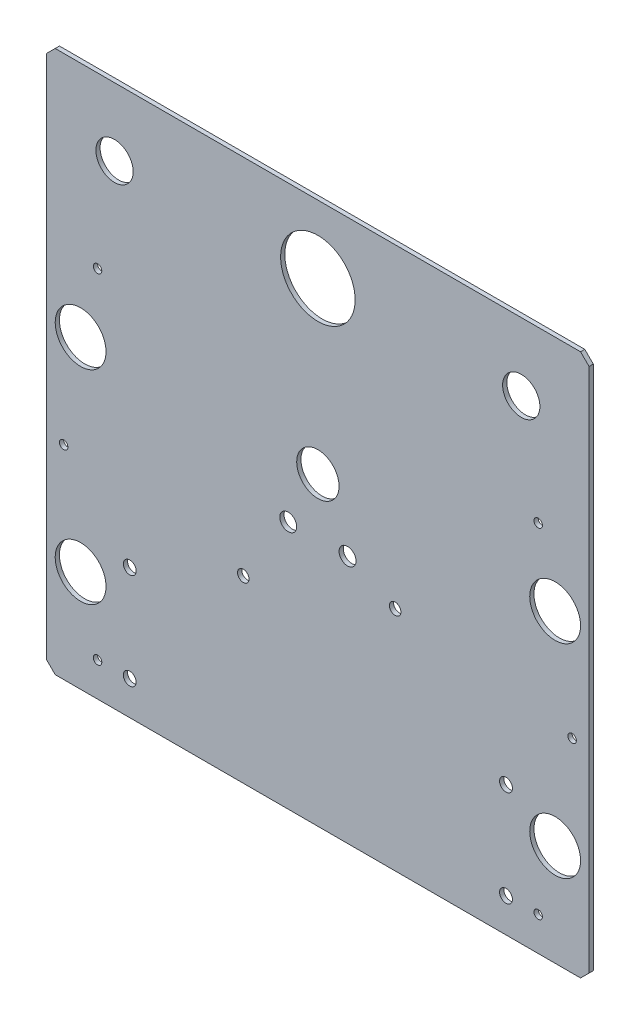
ISO-10303-21;
HEADER;
FILE_DESCRIPTION(('STEP AP214'),'2;1');
FILE_NAME('part.step','',(''),(''),'','','');
FILE_SCHEMA(('AUTOMOTIVE_DESIGN { 1 0 10303 214 1 1 1 1 }'));
ENDSEC;
DATA;
#1=APPLICATION_CONTEXT('core data for automotive mechanical design processes');
#2=APPLICATION_PROTOCOL_DEFINITION('international standard','automotive_design',2000,#1);
#3=PRODUCT_CONTEXT('',#1,'mechanical');
#4=PRODUCT('Part','Part','',(#3));
#5=PRODUCT_RELATED_PRODUCT_CATEGORY('part','',(#4));
#6=PRODUCT_DEFINITION_FORMATION('','',#4);
#7=PRODUCT_DEFINITION_CONTEXT('part definition',#1,'design');
#8=PRODUCT_DEFINITION('design','',#6,#7);
#9=PRODUCT_DEFINITION_SHAPE('','',#8);
#10=(LENGTH_UNIT() NAMED_UNIT(*) SI_UNIT(.MILLI.,.METRE.));
#11=(NAMED_UNIT(*) PLANE_ANGLE_UNIT() SI_UNIT($,.RADIAN.));
#12=(NAMED_UNIT(*) SI_UNIT($,.STERADIAN.) SOLID_ANGLE_UNIT());
#13=UNCERTAINTY_MEASURE_WITH_UNIT(LENGTH_MEASURE(1.E-05),#10,'distance_accuracy_value','');
#14=(GEOMETRIC_REPRESENTATION_CONTEXT(3) GLOBAL_UNCERTAINTY_ASSIGNED_CONTEXT((#13)) GLOBAL_UNIT_ASSIGNED_CONTEXT((#10,
#11,#12)) REPRESENTATION_CONTEXT('',''));
#15=CARTESIAN_POINT('',(0.,0.,0.));
#16=DIRECTION('',(0.,0.,1.));
#17=DIRECTION('',(1.,0.,0.));
#18=AXIS2_PLACEMENT_3D('',#15,#16,#17);
#19=CARTESIAN_POINT('',(0.,0.,-1.5875));
#20=DIRECTION('',(-1.,0.,0.));
#21=DIRECTION('',(0.,0.,1.));
#22=AXIS2_PLACEMENT_3D('',#19,#20,#21);
#23=PLANE('',#22);
#24=DIRECTION('',(0.,-1.,0.));
#25=VECTOR('',#24,1.);
#26=CARTESIAN_POINT('',(0.,0.,0.));
#27=LINE('',#26,#25);
#28=CARTESIAN_POINT('',(0.,200.025,0.));
#29=VERTEX_POINT('',#28);
#30=CARTESIAN_POINT('',(0.,3.17500000000002,0.));
#31=VERTEX_POINT('',#30);
#32=EDGE_CURVE('E99',#29,#31,#27,.T.);
#33=ORIENTED_EDGE('',*,*,#32,.F.);
#34=DIRECTION('',(0.,0.,-1.));
#35=VECTOR('',#34,1.);
#36=CARTESIAN_POINT('',(0.,200.025,-1.5875));
#37=LINE('',#36,#35);
#38=CARTESIAN_POINT('',(0.,200.025,-1.5875));
#39=VERTEX_POINT('',#38);
#40=EDGE_CURVE('E47',#29,#39,#37,.T.);
#41=ORIENTED_EDGE('',*,*,#40,.T.);
#42=DIRECTION('',(0.,-1.,0.));
#43=VECTOR('',#42,1.);
#44=CARTESIAN_POINT('',(0.,0.,-1.5875));
#45=LINE('',#44,#43);
#46=CARTESIAN_POINT('',(0.,3.17500000000002,-1.5875));
#47=VERTEX_POINT('',#46);
#48=EDGE_CURVE('E117',#39,#47,#45,.T.);
#49=ORIENTED_EDGE('',*,*,#48,.T.);
#50=DIRECTION('',(0.,0.,1.));
#51=VECTOR('',#50,1.);
#52=CARTESIAN_POINT('',(0.,3.17500000000002,-1.5875));
#53=LINE('',#52,#51);
#54=EDGE_CURVE('E114',#47,#31,#53,.T.);
#55=ORIENTED_EDGE('',*,*,#54,.T.);
#56=EDGE_LOOP('',(#33,#41,#49,#55));
#57=FACE_BOUND('',#56,.T.);
#58=ADVANCED_FACE('F38',(#57),#23,.T.);
#59=CARTESIAN_POINT('',(0.,203.2,-1.5875));
#60=DIRECTION('',(0.,1.,0.));
#61=DIRECTION('',(0.,0.,1.));
#62=AXIS2_PLACEMENT_3D('',#59,#60,#61);
#63=PLANE('',#62);
#64=DIRECTION('',(-1.,0.,0.));
#65=VECTOR('',#64,1.);
#66=CARTESIAN_POINT('',(0.,203.2,-1.5875));
#67=LINE('',#66,#65);
#68=CARTESIAN_POINT('',(200.025,203.2,-1.5875));
#69=VERTEX_POINT('',#68);
#70=CARTESIAN_POINT('',(3.17500000000002,203.2,-1.5875));
#71=VERTEX_POINT('',#70);
#72=EDGE_CURVE('E119',#69,#71,#67,.T.);
#73=ORIENTED_EDGE('',*,*,#72,.T.);
#74=DIRECTION('',(0.,0.,1.));
#75=VECTOR('',#74,1.);
#76=CARTESIAN_POINT('',(3.17500000000002,203.2,-1.5875));
#77=LINE('',#76,#75);
#78=CARTESIAN_POINT('',(3.17500000000002,203.2,0.));
#79=VERTEX_POINT('',#78);
#80=EDGE_CURVE('E149',#71,#79,#77,.T.);
#81=ORIENTED_EDGE('',*,*,#80,.T.);
#82=DIRECTION('',(-1.,0.,0.));
#83=VECTOR('',#82,1.);
#84=CARTESIAN_POINT('',(0.,203.2,0.));
#85=LINE('',#84,#83);
#86=CARTESIAN_POINT('',(200.025,203.2,0.));
#87=VERTEX_POINT('',#86);
#88=EDGE_CURVE('E125',#87,#79,#85,.T.);
#89=ORIENTED_EDGE('',*,*,#88,.F.);
#90=DIRECTION('',(0.,0.,-1.));
#91=VECTOR('',#90,1.);
#92=CARTESIAN_POINT('',(200.025,203.2,-1.5875));
#93=LINE('',#92,#91);
#94=EDGE_CURVE('E145',#87,#69,#93,.T.);
#95=ORIENTED_EDGE('',*,*,#94,.T.);
#96=EDGE_LOOP('',(#73,#81,#89,#95));
#97=FACE_BOUND('',#96,.T.);
#98=ADVANCED_FACE('F155',(#97),#63,.T.);
#99=CARTESIAN_POINT('',(203.2,0.,-1.5875));
#100=DIRECTION('',(1.,0.,0.));
#101=DIRECTION('',(0.,0.,-1.));
#102=AXIS2_PLACEMENT_3D('',#99,#100,#101);
#103=PLANE('',#102);
#104=DIRECTION('',(0.,1.,0.));
#105=VECTOR('',#104,1.);
#106=CARTESIAN_POINT('',(203.2,0.,-1.5875));
#107=LINE('',#106,#105);
#108=CARTESIAN_POINT('',(203.2,3.17500000000002,-1.5875));
#109=VERTEX_POINT('',#108);
#110=CARTESIAN_POINT('',(203.2,200.025,-1.5875));
#111=VERTEX_POINT('',#110);
#112=EDGE_CURVE('E122',#109,#111,#107,.T.);
#113=ORIENTED_EDGE('',*,*,#112,.T.);
#114=DIRECTION('',(0.,0.,1.));
#115=VECTOR('',#114,1.);
#116=CARTESIAN_POINT('',(203.2,200.025,-1.5875));
#117=LINE('',#116,#115);
#118=CARTESIAN_POINT('',(203.2,200.025,0.));
#119=VERTEX_POINT('',#118);
#120=EDGE_CURVE('E140',#111,#119,#117,.T.);
#121=ORIENTED_EDGE('',*,*,#120,.T.);
#122=DIRECTION('',(0.,1.,0.));
#123=VECTOR('',#122,1.);
#124=CARTESIAN_POINT('',(203.2,0.,0.));
#125=LINE('',#124,#123);
#126=CARTESIAN_POINT('',(203.2,3.17500000000002,0.));
#127=VERTEX_POINT('',#126);
#128=EDGE_CURVE('E161',#127,#119,#125,.T.);
#129=ORIENTED_EDGE('',*,*,#128,.F.);
#130=DIRECTION('',(0.,0.,-1.));
#131=VECTOR('',#130,1.);
#132=CARTESIAN_POINT('',(203.2,3.17500000000002,-1.5875));
#133=LINE('',#132,#131);
#134=EDGE_CURVE('E136',#127,#109,#133,.T.);
#135=ORIENTED_EDGE('',*,*,#134,.T.);
#136=EDGE_LOOP('',(#113,#121,#129,#135));
#137=FACE_BOUND('',#136,.T.);
#138=ADVANCED_FACE('F377',(#137),#103,.T.);
#139=CARTESIAN_POINT('',(0.,0.,-1.5875));
#140=DIRECTION('',(0.,-1.,0.));
#141=DIRECTION('',(0.,0.,-1.));
#142=AXIS2_PLACEMENT_3D('',#139,#140,#141);
#143=PLANE('',#142);
#144=DIRECTION('',(1.,0.,0.));
#145=VECTOR('',#144,1.);
#146=CARTESIAN_POINT('',(0.,0.,-1.5875));
#147=LINE('',#146,#145);
#148=CARTESIAN_POINT('',(3.17500000000002,0.,-1.5875));
#149=VERTEX_POINT('',#148);
#150=CARTESIAN_POINT('',(200.025,0.,-1.5875));
#151=VERTEX_POINT('',#150);
#152=EDGE_CURVE('E162',#149,#151,#147,.T.);
#153=ORIENTED_EDGE('',*,*,#152,.T.);
#154=DIRECTION('',(0.,0.,1.));
#155=VECTOR('',#154,1.);
#156=CARTESIAN_POINT('',(200.025,0.,-1.5875));
#157=LINE('',#156,#155);
#158=CARTESIAN_POINT('',(200.025,0.,0.));
#159=VERTEX_POINT('',#158);
#160=EDGE_CURVE('E131',#151,#159,#157,.T.);
#161=ORIENTED_EDGE('',*,*,#160,.T.);
#162=DIRECTION('',(1.,0.,0.));
#163=VECTOR('',#162,1.);
#164=CARTESIAN_POINT('',(0.,0.,0.));
#165=LINE('',#164,#163);
#166=CARTESIAN_POINT('',(3.17500000000002,0.,0.));
#167=VERTEX_POINT('',#166);
#168=EDGE_CURVE('E106',#167,#159,#165,.T.);
#169=ORIENTED_EDGE('',*,*,#168,.F.);
#170=DIRECTION('',(0.,0.,-1.));
#171=VECTOR('',#170,1.);
#172=CARTESIAN_POINT('',(3.17500000000002,0.,-1.5875));
#173=LINE('',#172,#171);
#174=EDGE_CURVE('E115',#167,#149,#173,.T.);
#175=ORIENTED_EDGE('',*,*,#174,.T.);
#176=EDGE_LOOP('',(#153,#161,#169,#175));
#177=FACE_BOUND('',#176,.T.);
#178=ADVANCED_FACE('F315',(#177),#143,.T.);
#179=CARTESIAN_POINT('',(0.,0.,-1.5875));
#180=DIRECTION('',(0.,0.,-1.));
#181=DIRECTION('',(-1.,0.,0.));
#182=AXIS2_PLACEMENT_3D('',#179,#180,#181);
#183=PLANE('',#182);
#184=CARTESIAN_POINT('',(177.8,177.8,-1.5875));
#185=DIRECTION('',(0.,0.,-1.));
#186=DIRECTION('',(-1.,0.,0.));
#187=AXIS2_PLACEMENT_3D('',#184,#185,#186);
#188=CIRCLE('',#187,6.98499999999999);
#189=CARTESIAN_POINT('',(170.815,177.8,-1.5875));
#190=VERTEX_POINT('',#189);
#191=EDGE_CURVE('E280',#190,#190,#188,.T.);
#192=ORIENTED_EDGE('',*,*,#191,.F.);
#193=EDGE_LOOP('',(#192));
#194=FACE_BOUND('',#193,.T.);
#195=CARTESIAN_POINT('',(73.6599999999998,67.31,-1.5875));
#196=DIRECTION('',(0.,0.,-1.));
#197=DIRECTION('',(-1.,0.,0.));
#198=AXIS2_PLACEMENT_3D('',#195,#196,#197);
#199=CIRCLE('',#198,2.15900000000001);
#200=CARTESIAN_POINT('',(71.5009999999998,67.31,-1.5875));
#201=VERTEX_POINT('',#200);
#202=EDGE_CURVE('E281',#201,#201,#199,.T.);
#203=ORIENTED_EDGE('',*,*,#202,.F.);
#204=EDGE_LOOP('',(#203));
#205=FACE_BOUND('',#204,.T.);
#206=CARTESIAN_POINT('',(130.556,85.09,-1.5875));
#207=DIRECTION('',(0.,0.,-1.));
#208=DIRECTION('',(-1.,0.,0.));
#209=AXIS2_PLACEMENT_3D('',#206,#207,#208);
#210=CIRCLE('',#209,2.15899999999999);
#211=CARTESIAN_POINT('',(128.397,85.09,-1.5875));
#212=VERTEX_POINT('',#211);
#213=EDGE_CURVE('E287',#212,#212,#210,.T.);
#214=ORIENTED_EDGE('',*,*,#213,.F.);
#215=EDGE_LOOP('',(#214));
#216=FACE_BOUND('',#215,.T.);
#217=CARTESIAN_POINT('',(90.4875,93.218,-1.5875));
#218=DIRECTION('',(0.,0.,-1.));
#219=DIRECTION('',(-1.,0.,0.));
#220=AXIS2_PLACEMENT_3D('',#217,#218,#219);
#221=CIRCLE('',#220,3.175);
#222=CARTESIAN_POINT('',(87.3125,93.218,-1.5875));
#223=VERTEX_POINT('',#222);
#224=EDGE_CURVE('E293',#223,#223,#221,.T.);
#225=ORIENTED_EDGE('',*,*,#224,.F.);
#226=EDGE_LOOP('',(#225));
#227=FACE_BOUND('',#226,.T.);
#228=CARTESIAN_POINT('',(112.7125,93.218,-1.5875));
#229=DIRECTION('',(0.,0.,-1.));
#230=DIRECTION('',(-1.,0.,0.));
#231=AXIS2_PLACEMENT_3D('',#228,#229,#230);
#232=CIRCLE('',#231,3.175);
#233=CARTESIAN_POINT('',(109.5375,93.218,-1.5875));
#234=VERTEX_POINT('',#233);
#235=EDGE_CURVE('E255',#234,#234,#232,.T.);
#236=ORIENTED_EDGE('',*,*,#235,.F.);
#237=EDGE_LOOP('',(#236));
#238=FACE_BOUND('',#237,.T.);
#239=CARTESIAN_POINT('',(101.6,114.3,-1.5875));
#240=DIRECTION('',(0.,0.,-1.));
#241=DIRECTION('',(-1.,0.,0.));
#242=AXIS2_PLACEMENT_3D('',#239,#240,#241);
#243=CIRCLE('',#242,7.93749999999998);
#244=CARTESIAN_POINT('',(93.6625,114.3,-1.5875));
#245=VERTEX_POINT('',#244);
#246=EDGE_CURVE('E262',#245,#245,#243,.T.);
#247=ORIENTED_EDGE('',*,*,#246,.F.);
#248=EDGE_LOOP('',(#247));
#249=FACE_BOUND('',#248,.T.);
#250=CARTESIAN_POINT('',(25.4,177.8,-1.5875));
#251=DIRECTION('',(0.,0.,-1.));
#252=DIRECTION('',(-1.,0.,0.));
#253=AXIS2_PLACEMENT_3D('',#250,#251,#252);
#254=CIRCLE('',#253,6.98500000000002);
#255=CARTESIAN_POINT('',(18.415,177.8,-1.5875));
#256=VERTEX_POINT('',#255);
#257=EDGE_CURVE('E268',#256,#256,#254,.T.);
#258=ORIENTED_EDGE('',*,*,#257,.F.);
#259=EDGE_LOOP('',(#258));
#260=FACE_BOUND('',#259,.T.);
#261=CARTESIAN_POINT('',(101.6,177.8,-1.5875));
#262=DIRECTION('',(0.,0.,-1.));
#263=DIRECTION('',(-1.,0.,0.));
#264=AXIS2_PLACEMENT_3D('',#261,#262,#263);
#265=CIRCLE('',#264,13.97);
#266=CARTESIAN_POINT('',(87.63,177.8,-1.5875));
#267=VERTEX_POINT('',#266);
#268=EDGE_CURVE('E274',#267,#267,#265,.T.);
#269=ORIENTED_EDGE('',*,*,#268,.F.);
#270=EDGE_LOOP('',(#269));
#271=FACE_BOUND('',#270,.T.);
#272=CARTESIAN_POINT('',(184.15,12.7,-1.5875));
#273=DIRECTION('',(0.,0.,-1.));
#274=DIRECTION('',(-1.,0.,0.));
#275=AXIS2_PLACEMENT_3D('',#272,#273,#274);
#276=CIRCLE('',#275,1.58749999999999);
#277=CARTESIAN_POINT('',(182.5625,12.7,-1.5875));
#278=VERTEX_POINT('',#277);
#279=EDGE_CURVE('E201',#278,#278,#276,.T.);
#280=ORIENTED_EDGE('',*,*,#279,.F.);
#281=EDGE_LOOP('',(#280));
#282=FACE_BOUND('',#281,.T.);
#283=CARTESIAN_POINT('',(184.15,139.7,-1.5875));
#284=DIRECTION('',(0.,0.,-1.));
#285=DIRECTION('',(-1.,0.,0.));
#286=AXIS2_PLACEMENT_3D('',#283,#284,#285);
#287=CIRCLE('',#286,1.58749999999999);
#288=CARTESIAN_POINT('',(182.5625,139.7,-1.5875));
#289=VERTEX_POINT('',#288);
#290=EDGE_CURVE('E208',#289,#289,#287,.T.);
#291=ORIENTED_EDGE('',*,*,#290,.F.);
#292=EDGE_LOOP('',(#291));
#293=FACE_BOUND('',#292,.T.);
#294=CARTESIAN_POINT('',(172.085,48.768,-1.5875));
#295=DIRECTION('',(0.,0.,-1.));
#296=DIRECTION('',(-1.,0.,0.));
#297=AXIS2_PLACEMENT_3D('',#294,#295,#296);
#298=CIRCLE('',#297,2.41299999999999);
#299=CARTESIAN_POINT('',(169.672,48.768,-1.5875));
#300=VERTEX_POINT('',#299);
#301=EDGE_CURVE('E214',#300,#300,#298,.T.);
#302=ORIENTED_EDGE('',*,*,#301,.F.);
#303=EDGE_LOOP('',(#302));
#304=FACE_BOUND('',#303,.T.);
#305=CARTESIAN_POINT('',(172.085,12.7,-1.5875));
#306=DIRECTION('',(0.,0.,-1.));
#307=DIRECTION('',(-1.,0.,0.));
#308=AXIS2_PLACEMENT_3D('',#305,#306,#307);
#309=CIRCLE('',#308,2.41299999999999);
#310=CARTESIAN_POINT('',(169.672,12.7,-1.5875));
#311=VERTEX_POINT('',#310);
#312=EDGE_CURVE('E220',#311,#311,#309,.T.);
#313=ORIENTED_EDGE('',*,*,#312,.F.);
#314=EDGE_LOOP('',(#313));
#315=FACE_BOUND('',#314,.T.);
#316=CARTESIAN_POINT('',(19.05,12.7,-1.5875));
#317=DIRECTION('',(0.,0.,-1.));
#318=DIRECTION('',(-1.,0.,0.));
#319=AXIS2_PLACEMENT_3D('',#316,#317,#318);
#320=CIRCLE('',#319,1.5875);
#321=CARTESIAN_POINT('',(17.4625,12.7,-1.5875));
#322=VERTEX_POINT('',#321);
#323=EDGE_CURVE('E184',#322,#322,#320,.T.);
#324=ORIENTED_EDGE('',*,*,#323,.F.);
#325=EDGE_LOOP('',(#324));
#326=FACE_BOUND('',#325,.T.);
#327=CARTESIAN_POINT('',(190.5,38.1,-1.5875));
#328=DIRECTION('',(0.,0.,-1.));
#329=DIRECTION('',(-1.,0.,0.));
#330=AXIS2_PLACEMENT_3D('',#327,#328,#329);
#331=CIRCLE('',#330,9.525);
#332=CARTESIAN_POINT('',(180.975,38.1,-1.5875));
#333=VERTEX_POINT('',#332);
#334=EDGE_CURVE('E177',#333,#333,#331,.T.);
#335=ORIENTED_EDGE('',*,*,#334,.F.);
#336=EDGE_LOOP('',(#335));
#337=FACE_BOUND('',#336,.T.);
#338=CARTESIAN_POINT('',(31.115,48.768,-1.5875));
#339=DIRECTION('',(0.,0.,-1.));
#340=DIRECTION('',(-1.,0.,0.));
#341=AXIS2_PLACEMENT_3D('',#338,#339,#340);
#342=CIRCLE('',#341,2.41299999999999);
#343=CARTESIAN_POINT('',(28.702,48.768,-1.5875));
#344=VERTEX_POINT('',#343);
#345=EDGE_CURVE('E196',#344,#344,#342,.T.);
#346=ORIENTED_EDGE('',*,*,#345,.F.);
#347=EDGE_LOOP('',(#346));
#348=FACE_BOUND('',#347,.T.);
#349=CARTESIAN_POINT('',(31.115,12.7,-1.5875));
#350=DIRECTION('',(0.,0.,-1.));
#351=DIRECTION('',(-1.,0.,0.));
#352=AXIS2_PLACEMENT_3D('',#349,#350,#351);
#353=CIRCLE('',#352,2.41300000000001);
#354=CARTESIAN_POINT('',(28.702,12.7,-1.5875));
#355=VERTEX_POINT('',#354);
#356=EDGE_CURVE('E189',#355,#355,#353,.T.);
#357=ORIENTED_EDGE('',*,*,#356,.F.);
#358=EDGE_LOOP('',(#357));
#359=FACE_BOUND('',#358,.T.);
#360=CARTESIAN_POINT('',(196.85,76.2,-1.5875));
#361=DIRECTION('',(0.,0.,-1.));
#362=DIRECTION('',(-1.,0.,0.));
#363=AXIS2_PLACEMENT_3D('',#360,#361,#362);
#364=CIRCLE('',#363,1.58749999999999);
#365=CARTESIAN_POINT('',(195.2625,76.2,-1.5875));
#366=VERTEX_POINT('',#365);
#367=EDGE_CURVE('E249',#366,#366,#364,.T.);
#368=ORIENTED_EDGE('',*,*,#367,.F.);
#369=EDGE_LOOP('',(#368));
#370=FACE_BOUND('',#369,.T.);
#371=CARTESIAN_POINT('',(6.35,76.2,-1.5875));
#372=DIRECTION('',(0.,0.,-1.));
#373=DIRECTION('',(-1.,0.,0.));
#374=AXIS2_PLACEMENT_3D('',#371,#372,#373);
#375=CIRCLE('',#374,1.5875);
#376=CARTESIAN_POINT('',(4.7625,76.2,-1.5875));
#377=VERTEX_POINT('',#376);
#378=EDGE_CURVE('E225',#377,#377,#375,.T.);
#379=ORIENTED_EDGE('',*,*,#378,.F.);
#380=EDGE_LOOP('',(#379));
#381=FACE_BOUND('',#380,.T.);
#382=CARTESIAN_POINT('',(12.7,38.1,-1.5875));
#383=DIRECTION('',(0.,0.,-1.));
#384=DIRECTION('',(-1.,0.,0.));
#385=AXIS2_PLACEMENT_3D('',#382,#383,#384);
#386=CIRCLE('',#385,9.525);
#387=CARTESIAN_POINT('',(3.17500000000004,38.1,-1.5875));
#388=VERTEX_POINT('',#387);
#389=EDGE_CURVE('E232',#388,#388,#386,.T.);
#390=ORIENTED_EDGE('',*,*,#389,.F.);
#391=EDGE_LOOP('',(#390));
#392=FACE_BOUND('',#391,.T.);
#393=CARTESIAN_POINT('',(12.7,114.3,-1.5875));
#394=DIRECTION('',(0.,0.,-1.));
#395=DIRECTION('',(-1.,0.,0.));
#396=AXIS2_PLACEMENT_3D('',#393,#394,#395);
#397=CIRCLE('',#396,9.52500000000001);
#398=CARTESIAN_POINT('',(3.17500000000003,114.3,-1.5875));
#399=VERTEX_POINT('',#398);
#400=EDGE_CURVE('E238',#399,#399,#397,.T.);
#401=ORIENTED_EDGE('',*,*,#400,.F.);
#402=EDGE_LOOP('',(#401));
#403=FACE_BOUND('',#402,.T.);
#404=CARTESIAN_POINT('',(190.5,114.3,-1.5875));
#405=DIRECTION('',(0.,0.,-1.));
#406=DIRECTION('',(-1.,0.,0.));
#407=AXIS2_PLACEMENT_3D('',#404,#405,#406);
#408=CIRCLE('',#407,9.525);
#409=CARTESIAN_POINT('',(180.975,114.3,-1.5875));
#410=VERTEX_POINT('',#409);
#411=EDGE_CURVE('E244',#410,#410,#408,.T.);
#412=ORIENTED_EDGE('',*,*,#411,.F.);
#413=EDGE_LOOP('',(#412));
#414=FACE_BOUND('',#413,.T.);
#415=CARTESIAN_POINT('',(19.05,139.7,-1.5875));
#416=DIRECTION('',(0.,0.,-1.));
#417=DIRECTION('',(-1.,0.,0.));
#418=AXIS2_PLACEMENT_3D('',#415,#416,#417);
#419=CIRCLE('',#418,1.5875);
#420=CARTESIAN_POINT('',(17.4625,139.7,-1.5875));
#421=VERTEX_POINT('',#420);
#422=EDGE_CURVE('E171',#421,#421,#419,.T.);
#423=ORIENTED_EDGE('',*,*,#422,.F.);
#424=EDGE_LOOP('',(#423));
#425=FACE_BOUND('',#424,.T.);
#426=ORIENTED_EDGE('',*,*,#48,.F.);
#427=DIRECTION('',(-0.707106781186549,-0.707106781186546,0.));
#428=VECTOR('',#427,1.);
#429=CARTESIAN_POINT('',(-100.0125,100.0125,-1.5875));
#430=LINE('',#429,#428);
#431=EDGE_CURVE('E11',#39,#71,#430,.F.);
#432=ORIENTED_EDGE('',*,*,#431,.T.);
#433=ORIENTED_EDGE('',*,*,#72,.F.);
#434=DIRECTION('',(-0.707106781186548,0.707106781186548,0.));
#435=VECTOR('',#434,1.);
#436=CARTESIAN_POINT('',(201.6125,201.6125,-1.5875));
#437=LINE('',#436,#435);
#438=EDGE_CURVE('E147',#69,#111,#437,.F.);
#439=ORIENTED_EDGE('',*,*,#438,.T.);
#440=ORIENTED_EDGE('',*,*,#112,.F.);
#441=DIRECTION('',(0.707106781186546,0.707106781186549,0.));
#442=VECTOR('',#441,1.);
#443=CARTESIAN_POINT('',(100.0125,-100.0125,-1.5875));
#444=LINE('',#443,#442);
#445=EDGE_CURVE('E138',#109,#151,#444,.F.);
#446=ORIENTED_EDGE('',*,*,#445,.T.);
#447=ORIENTED_EDGE('',*,*,#152,.F.);
#448=DIRECTION('',(0.707106781186548,-0.707106781186548,0.));
#449=VECTOR('',#448,1.);
#450=CARTESIAN_POINT('',(1.58750000000001,1.58750000000001,-1.5875));
#451=LINE('',#450,#449);
#452=EDGE_CURVE('E129',#149,#47,#451,.F.);
#453=ORIENTED_EDGE('',*,*,#452,.T.);
#454=EDGE_LOOP('',(#426,#432,#433,#439,#440,#446,#447,#453));
#455=FACE_BOUND('',#454,.T.);
#456=ADVANCED_FACE('F312',(#194,#205,#216,#227,#238,#249,#260,#271,#282,#293,#304,#315,#326,
#337,#348,#359,#370,#381,#392,#403,#414,#425,#455),#183,.T.);
#457=CARTESIAN_POINT('',(0.,0.,0.));
#458=DIRECTION('',(0.,0.,-1.));
#459=DIRECTION('',(-1.,0.,0.));
#460=AXIS2_PLACEMENT_3D('',#457,#458,#459);
#461=PLANE('',#460);
#462=CARTESIAN_POINT('',(177.8,177.8,0.));
#463=DIRECTION('',(0.,0.,-1.));
#464=DIRECTION('',(-1.,0.,0.));
#465=AXIS2_PLACEMENT_3D('',#462,#463,#464);
#466=CIRCLE('',#465,6.98499999999999);
#467=CARTESIAN_POINT('',(170.815,177.8,0.));
#468=VERTEX_POINT('',#467);
#469=EDGE_CURVE('E252',#468,#468,#466,.T.);
#470=ORIENTED_EDGE('',*,*,#469,.T.);
#471=EDGE_LOOP('',(#470));
#472=FACE_BOUND('',#471,.T.);
#473=CARTESIAN_POINT('',(73.6599999999998,67.31,0.));
#474=DIRECTION('',(0.,0.,-1.));
#475=DIRECTION('',(-1.,0.,0.));
#476=AXIS2_PLACEMENT_3D('',#473,#474,#475);
#477=CIRCLE('',#476,2.15900000000001);
#478=CARTESIAN_POINT('',(71.5009999999998,67.31,0.));
#479=VERTEX_POINT('',#478);
#480=EDGE_CURVE('E284',#479,#479,#477,.T.);
#481=ORIENTED_EDGE('',*,*,#480,.T.);
#482=EDGE_LOOP('',(#481));
#483=FACE_BOUND('',#482,.T.);
#484=CARTESIAN_POINT('',(130.556,85.09,0.));
#485=DIRECTION('',(0.,0.,-1.));
#486=DIRECTION('',(-1.,0.,0.));
#487=AXIS2_PLACEMENT_3D('',#484,#485,#486);
#488=CIRCLE('',#487,2.15899999999999);
#489=CARTESIAN_POINT('',(128.397,85.09,0.));
#490=VERTEX_POINT('',#489);
#491=EDGE_CURVE('E290',#490,#490,#488,.T.);
#492=ORIENTED_EDGE('',*,*,#491,.T.);
#493=EDGE_LOOP('',(#492));
#494=FACE_BOUND('',#493,.T.);
#495=CARTESIAN_POINT('',(90.4875,93.218,0.));
#496=DIRECTION('',(0.,0.,-1.));
#497=DIRECTION('',(-1.,0.,0.));
#498=AXIS2_PLACEMENT_3D('',#495,#496,#497);
#499=CIRCLE('',#498,3.175);
#500=CARTESIAN_POINT('',(87.3125,93.218,0.));
#501=VERTEX_POINT('',#500);
#502=EDGE_CURVE('E259',#501,#501,#499,.T.);
#503=ORIENTED_EDGE('',*,*,#502,.T.);
#504=EDGE_LOOP('',(#503));
#505=FACE_BOUND('',#504,.T.);
#506=CARTESIAN_POINT('',(112.7125,93.218,0.));
#507=DIRECTION('',(0.,0.,-1.));
#508=DIRECTION('',(-1.,0.,0.));
#509=AXIS2_PLACEMENT_3D('',#506,#507,#508);
#510=CIRCLE('',#509,3.175);
#511=CARTESIAN_POINT('',(109.5375,93.218,0.));
#512=VERTEX_POINT('',#511);
#513=EDGE_CURVE('E258',#512,#512,#510,.T.);
#514=ORIENTED_EDGE('',*,*,#513,.T.);
#515=EDGE_LOOP('',(#514));
#516=FACE_BOUND('',#515,.T.);
#517=CARTESIAN_POINT('',(101.6,114.3,0.));
#518=DIRECTION('',(0.,0.,-1.));
#519=DIRECTION('',(-1.,0.,0.));
#520=AXIS2_PLACEMENT_3D('',#517,#518,#519);
#521=CIRCLE('',#520,7.93749999999998);
#522=CARTESIAN_POINT('',(93.6625,114.3,0.));
#523=VERTEX_POINT('',#522);
#524=EDGE_CURVE('E265',#523,#523,#521,.T.);
#525=ORIENTED_EDGE('',*,*,#524,.T.);
#526=EDGE_LOOP('',(#525));
#527=FACE_BOUND('',#526,.T.);
#528=CARTESIAN_POINT('',(25.4,177.8,0.));
#529=DIRECTION('',(0.,0.,-1.));
#530=DIRECTION('',(-1.,0.,0.));
#531=AXIS2_PLACEMENT_3D('',#528,#529,#530);
#532=CIRCLE('',#531,6.98500000000002);
#533=CARTESIAN_POINT('',(18.415,177.8,0.));
#534=VERTEX_POINT('',#533);
#535=EDGE_CURVE('E271',#534,#534,#532,.T.);
#536=ORIENTED_EDGE('',*,*,#535,.T.);
#537=EDGE_LOOP('',(#536));
#538=FACE_BOUND('',#537,.T.);
#539=CARTESIAN_POINT('',(101.6,177.8,0.));
#540=DIRECTION('',(0.,0.,-1.));
#541=DIRECTION('',(-1.,0.,0.));
#542=AXIS2_PLACEMENT_3D('',#539,#540,#541);
#543=CIRCLE('',#542,13.97);
#544=CARTESIAN_POINT('',(87.63,177.8,0.));
#545=VERTEX_POINT('',#544);
#546=EDGE_CURVE('E277',#545,#545,#543,.T.);
#547=ORIENTED_EDGE('',*,*,#546,.T.);
#548=EDGE_LOOP('',(#547));
#549=FACE_BOUND('',#548,.T.);
#550=CARTESIAN_POINT('',(184.15,12.7,0.));
#551=DIRECTION('',(0.,0.,-1.));
#552=DIRECTION('',(-1.,0.,0.));
#553=AXIS2_PLACEMENT_3D('',#550,#551,#552);
#554=CIRCLE('',#553,1.58749999999999);
#555=CARTESIAN_POINT('',(182.5625,12.7,0.));
#556=VERTEX_POINT('',#555);
#557=EDGE_CURVE('E204',#556,#556,#554,.T.);
#558=ORIENTED_EDGE('',*,*,#557,.T.);
#559=EDGE_LOOP('',(#558));
#560=FACE_BOUND('',#559,.T.);
#561=CARTESIAN_POINT('',(184.15,139.7,0.));
#562=DIRECTION('',(0.,0.,-1.));
#563=DIRECTION('',(-1.,0.,0.));
#564=AXIS2_PLACEMENT_3D('',#561,#562,#563);
#565=CIRCLE('',#564,1.58749999999999);
#566=CARTESIAN_POINT('',(182.5625,139.7,0.));
#567=VERTEX_POINT('',#566);
#568=EDGE_CURVE('E211',#567,#567,#565,.T.);
#569=ORIENTED_EDGE('',*,*,#568,.T.);
#570=EDGE_LOOP('',(#569));
#571=FACE_BOUND('',#570,.T.);
#572=CARTESIAN_POINT('',(172.085,48.768,0.));
#573=DIRECTION('',(0.,0.,-1.));
#574=DIRECTION('',(-1.,0.,0.));
#575=AXIS2_PLACEMENT_3D('',#572,#573,#574);
#576=CIRCLE('',#575,2.41299999999999);
#577=CARTESIAN_POINT('',(169.672,48.768,0.));
#578=VERTEX_POINT('',#577);
#579=EDGE_CURVE('E217',#578,#578,#576,.T.);
#580=ORIENTED_EDGE('',*,*,#579,.T.);
#581=EDGE_LOOP('',(#580));
#582=FACE_BOUND('',#581,.T.);
#583=CARTESIAN_POINT('',(172.085,12.7,0.));
#584=DIRECTION('',(0.,0.,-1.));
#585=DIRECTION('',(-1.,0.,0.));
#586=AXIS2_PLACEMENT_3D('',#583,#584,#585);
#587=CIRCLE('',#586,2.41299999999999);
#588=CARTESIAN_POINT('',(169.672,12.7,0.));
#589=VERTEX_POINT('',#588);
#590=EDGE_CURVE('E193',#589,#589,#587,.T.);
#591=ORIENTED_EDGE('',*,*,#590,.T.);
#592=EDGE_LOOP('',(#591));
#593=FACE_BOUND('',#592,.T.);
#594=CARTESIAN_POINT('',(19.05,12.7,0.));
#595=DIRECTION('',(0.,0.,-1.));
#596=DIRECTION('',(-1.,0.,0.));
#597=AXIS2_PLACEMENT_3D('',#594,#595,#596);
#598=CIRCLE('',#597,1.5875);
#599=CARTESIAN_POINT('',(17.4625,12.7,0.));
#600=VERTEX_POINT('',#599);
#601=EDGE_CURVE('E174',#600,#600,#598,.T.);
#602=ORIENTED_EDGE('',*,*,#601,.T.);
#603=EDGE_LOOP('',(#602));
#604=FACE_BOUND('',#603,.T.);
#605=CARTESIAN_POINT('',(190.5,38.1,0.));
#606=DIRECTION('',(0.,0.,-1.));
#607=DIRECTION('',(-1.,0.,0.));
#608=AXIS2_PLACEMENT_3D('',#605,#606,#607);
#609=CIRCLE('',#608,9.525);
#610=CARTESIAN_POINT('',(180.975,38.1,0.));
#611=VERTEX_POINT('',#610);
#612=EDGE_CURVE('E180',#611,#611,#609,.T.);
#613=ORIENTED_EDGE('',*,*,#612,.T.);
#614=EDGE_LOOP('',(#613));
#615=FACE_BOUND('',#614,.T.);
#616=CARTESIAN_POINT('',(31.115,48.768,0.));
#617=DIRECTION('',(0.,0.,-1.));
#618=DIRECTION('',(-1.,0.,0.));
#619=AXIS2_PLACEMENT_3D('',#616,#617,#618);
#620=CIRCLE('',#619,2.41299999999999);
#621=CARTESIAN_POINT('',(28.702,48.768,0.));
#622=VERTEX_POINT('',#621);
#623=EDGE_CURVE('E181',#622,#622,#620,.T.);
#624=ORIENTED_EDGE('',*,*,#623,.T.);
#625=EDGE_LOOP('',(#624));
#626=FACE_BOUND('',#625,.T.);
#627=CARTESIAN_POINT('',(31.115,12.7,0.));
#628=DIRECTION('',(0.,0.,-1.));
#629=DIRECTION('',(-1.,0.,0.));
#630=AXIS2_PLACEMENT_3D('',#627,#628,#629);
#631=CIRCLE('',#630,2.41300000000001);
#632=CARTESIAN_POINT('',(28.702,12.7,0.));
#633=VERTEX_POINT('',#632);
#634=EDGE_CURVE('E192',#633,#633,#631,.T.);
#635=ORIENTED_EDGE('',*,*,#634,.T.);
#636=EDGE_LOOP('',(#635));
#637=FACE_BOUND('',#636,.T.);
#638=CARTESIAN_POINT('',(196.85,76.2,0.));
#639=DIRECTION('',(0.,0.,-1.));
#640=DIRECTION('',(-1.,0.,0.));
#641=AXIS2_PLACEMENT_3D('',#638,#639,#640);
#642=CIRCLE('',#641,1.58749999999999);
#643=CARTESIAN_POINT('',(195.2625,76.2,0.));
#644=VERTEX_POINT('',#643);
#645=EDGE_CURVE('E229',#644,#644,#642,.T.);
#646=ORIENTED_EDGE('',*,*,#645,.T.);
#647=EDGE_LOOP('',(#646));
#648=FACE_BOUND('',#647,.T.);
#649=CARTESIAN_POINT('',(6.35,76.2,0.));
#650=DIRECTION('',(0.,0.,-1.));
#651=DIRECTION('',(-1.,0.,0.));
#652=AXIS2_PLACEMENT_3D('',#649,#650,#651);
#653=CIRCLE('',#652,1.5875);
#654=CARTESIAN_POINT('',(4.7625,76.2,0.));
#655=VERTEX_POINT('',#654);
#656=EDGE_CURVE('E228',#655,#655,#653,.T.);
#657=ORIENTED_EDGE('',*,*,#656,.T.);
#658=EDGE_LOOP('',(#657));
#659=FACE_BOUND('',#658,.T.);
#660=CARTESIAN_POINT('',(12.7,38.1,0.));
#661=DIRECTION('',(0.,0.,-1.));
#662=DIRECTION('',(-1.,0.,0.));
#663=AXIS2_PLACEMENT_3D('',#660,#661,#662);
#664=CIRCLE('',#663,9.525);
#665=CARTESIAN_POINT('',(3.17500000000004,38.1,0.));
#666=VERTEX_POINT('',#665);
#667=EDGE_CURVE('E235',#666,#666,#664,.T.);
#668=ORIENTED_EDGE('',*,*,#667,.T.);
#669=EDGE_LOOP('',(#668));
#670=FACE_BOUND('',#669,.T.);
#671=CARTESIAN_POINT('',(12.7,114.3,0.));
#672=DIRECTION('',(0.,0.,-1.));
#673=DIRECTION('',(-1.,0.,0.));
#674=AXIS2_PLACEMENT_3D('',#671,#672,#673);
#675=CIRCLE('',#674,9.52500000000001);
#676=CARTESIAN_POINT('',(3.17500000000003,114.3,0.));
#677=VERTEX_POINT('',#676);
#678=EDGE_CURVE('E241',#677,#677,#675,.T.);
#679=ORIENTED_EDGE('',*,*,#678,.T.);
#680=EDGE_LOOP('',(#679));
#681=FACE_BOUND('',#680,.T.);
#682=CARTESIAN_POINT('',(190.5,114.3,0.));
#683=DIRECTION('',(0.,0.,-1.));
#684=DIRECTION('',(-1.,0.,0.));
#685=AXIS2_PLACEMENT_3D('',#682,#683,#684);
#686=CIRCLE('',#685,9.525);
#687=CARTESIAN_POINT('',(180.975,114.3,0.));
#688=VERTEX_POINT('',#687);
#689=EDGE_CURVE('E205',#688,#688,#686,.T.);
#690=ORIENTED_EDGE('',*,*,#689,.T.);
#691=EDGE_LOOP('',(#690));
#692=FACE_BOUND('',#691,.T.);
#693=CARTESIAN_POINT('',(19.05,139.7,0.));
#694=DIRECTION('',(0.,0.,-1.));
#695=DIRECTION('',(-1.,0.,0.));
#696=AXIS2_PLACEMENT_3D('',#693,#694,#695);
#697=CIRCLE('',#696,1.5875);
#698=CARTESIAN_POINT('',(17.4625,139.7,0.));
#699=VERTEX_POINT('',#698);
#700=EDGE_CURVE('E107',#699,#699,#697,.T.);
#701=ORIENTED_EDGE('',*,*,#700,.T.);
#702=EDGE_LOOP('',(#701));
#703=FACE_BOUND('',#702,.T.);
#704=ORIENTED_EDGE('',*,*,#88,.T.);
#705=DIRECTION('',(0.707106781186549,0.707106781186546,0.));
#706=VECTOR('',#705,1.);
#707=CARTESIAN_POINT('',(3.17500000000002,203.2,0.));
#708=LINE('',#707,#706);
#709=EDGE_CURVE('E61',#79,#29,#708,.F.);
#710=ORIENTED_EDGE('',*,*,#709,.T.);
#711=ORIENTED_EDGE('',*,*,#32,.T.);
#712=DIRECTION('',(-0.707106781186548,0.707106781186548,0.));
#713=VECTOR('',#712,1.);
#714=CARTESIAN_POINT('',(0.,3.17500000000002,0.));
#715=LINE('',#714,#713);
#716=EDGE_CURVE('E103',#31,#167,#715,.F.);
#717=ORIENTED_EDGE('',*,*,#716,.T.);
#718=ORIENTED_EDGE('',*,*,#168,.T.);
#719=DIRECTION('',(-0.707106781186546,-0.707106781186549,0.));
#720=VECTOR('',#719,1.);
#721=CARTESIAN_POINT('',(200.025,0.,0.));
#722=LINE('',#721,#720);
#723=EDGE_CURVE('E134',#159,#127,#722,.F.);
#724=ORIENTED_EDGE('',*,*,#723,.T.);
#725=ORIENTED_EDGE('',*,*,#128,.T.);
#726=DIRECTION('',(0.707106781186548,-0.707106781186548,0.));
#727=VECTOR('',#726,1.);
#728=CARTESIAN_POINT('',(203.2,200.025,0.));
#729=LINE('',#728,#727);
#730=EDGE_CURVE('E143',#119,#87,#729,.F.);
#731=ORIENTED_EDGE('',*,*,#730,.T.);
#732=EDGE_LOOP('',(#704,#710,#711,#717,#718,#724,#725,#731));
#733=FACE_BOUND('',#732,.T.);
#734=ADVANCED_FACE('F101',(#472,#483,#494,#505,#516,#527,#538,#549,#560,#571,#582,#593,#604,
#615,#626,#637,#648,#659,#670,#681,#692,#703,#733),#461,.F.);
#735=CARTESIAN_POINT('',(19.05,139.7,0.));
#736=DIRECTION('',(0.,0.,-1.));
#737=DIRECTION('',(-1.,0.,0.));
#738=AXIS2_PLACEMENT_3D('',#735,#736,#737);
#739=CYLINDRICAL_SURFACE('',#738,1.5875);
#740=ORIENTED_EDGE('',*,*,#700,.F.);
#741=EDGE_LOOP('',(#740));
#742=FACE_BOUND('',#741,.T.);
#743=ORIENTED_EDGE('',*,*,#422,.T.);
#744=EDGE_LOOP('',(#743));
#745=FACE_BOUND('',#744,.T.);
#746=ADVANCED_FACE('F414',(#742,#745),#739,.F.);
#747=CARTESIAN_POINT('',(190.5,114.3,0.));
#748=DIRECTION('',(0.,0.,-1.));
#749=DIRECTION('',(-1.,0.,0.));
#750=AXIS2_PLACEMENT_3D('',#747,#748,#749);
#751=CYLINDRICAL_SURFACE('',#750,9.525);
#752=ORIENTED_EDGE('',*,*,#689,.F.);
#753=EDGE_LOOP('',(#752));
#754=FACE_BOUND('',#753,.T.);
#755=ORIENTED_EDGE('',*,*,#411,.T.);
#756=EDGE_LOOP('',(#755));
#757=FACE_BOUND('',#756,.T.);
#758=ADVANCED_FACE('F418',(#754,#757),#751,.F.);
#759=CARTESIAN_POINT('',(12.7,114.3,0.));
#760=DIRECTION('',(0.,0.,-1.));
#761=DIRECTION('',(-1.,0.,0.));
#762=AXIS2_PLACEMENT_3D('',#759,#760,#761);
#763=CYLINDRICAL_SURFACE('',#762,9.52500000000001);
#764=ORIENTED_EDGE('',*,*,#678,.F.);
#765=EDGE_LOOP('',(#764));
#766=FACE_BOUND('',#765,.T.);
#767=ORIENTED_EDGE('',*,*,#400,.T.);
#768=EDGE_LOOP('',(#767));
#769=FACE_BOUND('',#768,.T.);
#770=ADVANCED_FACE('F459',(#766,#769),#763,.F.);
#771=CARTESIAN_POINT('',(12.7,38.1,0.));
#772=DIRECTION('',(0.,0.,-1.));
#773=DIRECTION('',(-1.,0.,0.));
#774=AXIS2_PLACEMENT_3D('',#771,#772,#773);
#775=CYLINDRICAL_SURFACE('',#774,9.525);
#776=ORIENTED_EDGE('',*,*,#667,.F.);
#777=EDGE_LOOP('',(#776));
#778=FACE_BOUND('',#777,.T.);
#779=ORIENTED_EDGE('',*,*,#389,.T.);
#780=EDGE_LOOP('',(#779));
#781=FACE_BOUND('',#780,.T.);
#782=ADVANCED_FACE('F455',(#778,#781),#775,.F.);
#783=CARTESIAN_POINT('',(6.35,76.2,0.));
#784=DIRECTION('',(0.,0.,-1.));
#785=DIRECTION('',(-1.,0.,0.));
#786=AXIS2_PLACEMENT_3D('',#783,#784,#785);
#787=CYLINDRICAL_SURFACE('',#786,1.5875);
#788=ORIENTED_EDGE('',*,*,#656,.F.);
#789=EDGE_LOOP('',(#788));
#790=FACE_BOUND('',#789,.T.);
#791=ORIENTED_EDGE('',*,*,#378,.T.);
#792=EDGE_LOOP('',(#791));
#793=FACE_BOUND('',#792,.T.);
#794=ADVANCED_FACE('F452',(#790,#793),#787,.F.);
#795=CARTESIAN_POINT('',(196.85,76.2,0.));
#796=DIRECTION('',(0.,0.,-1.));
#797=DIRECTION('',(-1.,0.,0.));
#798=AXIS2_PLACEMENT_3D('',#795,#796,#797);
#799=CYLINDRICAL_SURFACE('',#798,1.58749999999999);
#800=ORIENTED_EDGE('',*,*,#645,.F.);
#801=EDGE_LOOP('',(#800));
#802=FACE_BOUND('',#801,.T.);
#803=ORIENTED_EDGE('',*,*,#367,.T.);
#804=EDGE_LOOP('',(#803));
#805=FACE_BOUND('',#804,.T.);
#806=ADVANCED_FACE('F433',(#802,#805),#799,.F.);
#807=CARTESIAN_POINT('',(31.115,12.7,0.));
#808=DIRECTION('',(0.,0.,-1.));
#809=DIRECTION('',(-1.,0.,0.));
#810=AXIS2_PLACEMENT_3D('',#807,#808,#809);
#811=CYLINDRICAL_SURFACE('',#810,2.41300000000001);
#812=ORIENTED_EDGE('',*,*,#634,.F.);
#813=EDGE_LOOP('',(#812));
#814=FACE_BOUND('',#813,.T.);
#815=ORIENTED_EDGE('',*,*,#356,.T.);
#816=EDGE_LOOP('',(#815));
#817=FACE_BOUND('',#816,.T.);
#818=ADVANCED_FACE('F430',(#814,#817),#811,.F.);
#819=CARTESIAN_POINT('',(31.115,48.768,0.));
#820=DIRECTION('',(0.,0.,-1.));
#821=DIRECTION('',(-1.,0.,0.));
#822=AXIS2_PLACEMENT_3D('',#819,#820,#821);
#823=CYLINDRICAL_SURFACE('',#822,2.41299999999999);
#824=ORIENTED_EDGE('',*,*,#623,.F.);
#825=EDGE_LOOP('',(#824));
#826=FACE_BOUND('',#825,.T.);
#827=ORIENTED_EDGE('',*,*,#345,.T.);
#828=EDGE_LOOP('',(#827));
#829=FACE_BOUND('',#828,.T.);
#830=ADVANCED_FACE('F424',(#826,#829),#823,.F.);
#831=CARTESIAN_POINT('',(190.5,38.1,0.));
#832=DIRECTION('',(0.,0.,-1.));
#833=DIRECTION('',(-1.,0.,0.));
#834=AXIS2_PLACEMENT_3D('',#831,#832,#833);
#835=CYLINDRICAL_SURFACE('',#834,9.525);
#836=ORIENTED_EDGE('',*,*,#612,.F.);
#837=EDGE_LOOP('',(#836));
#838=FACE_BOUND('',#837,.T.);
#839=ORIENTED_EDGE('',*,*,#334,.T.);
#840=EDGE_LOOP('',(#839));
#841=FACE_BOUND('',#840,.T.);
#842=ADVANCED_FACE('F420',(#838,#841),#835,.F.);
#843=CARTESIAN_POINT('',(19.05,12.7,0.));
#844=DIRECTION('',(0.,0.,-1.));
#845=DIRECTION('',(-1.,0.,0.));
#846=AXIS2_PLACEMENT_3D('',#843,#844,#845);
#847=CYLINDRICAL_SURFACE('',#846,1.5875);
#848=ORIENTED_EDGE('',*,*,#601,.F.);
#849=EDGE_LOOP('',(#848));
#850=FACE_BOUND('',#849,.T.);
#851=ORIENTED_EDGE('',*,*,#323,.T.);
#852=EDGE_LOOP('',(#851));
#853=FACE_BOUND('',#852,.T.);
#854=ADVANCED_FACE('F423',(#850,#853),#847,.F.);
#855=CARTESIAN_POINT('',(172.085,12.7,0.));
#856=DIRECTION('',(0.,0.,-1.));
#857=DIRECTION('',(-1.,0.,0.));
#858=AXIS2_PLACEMENT_3D('',#855,#856,#857);
#859=CYLINDRICAL_SURFACE('',#858,2.41299999999999);
#860=ORIENTED_EDGE('',*,*,#590,.F.);
#861=EDGE_LOOP('',(#860));
#862=FACE_BOUND('',#861,.T.);
#863=ORIENTED_EDGE('',*,*,#312,.T.);
#864=EDGE_LOOP('',(#863));
#865=FACE_BOUND('',#864,.T.);
#866=ADVANCED_FACE('F428',(#862,#865),#859,.F.);
#867=CARTESIAN_POINT('',(172.085,48.768,0.));
#868=DIRECTION('',(0.,0.,-1.));
#869=DIRECTION('',(-1.,0.,0.));
#870=AXIS2_PLACEMENT_3D('',#867,#868,#869);
#871=CYLINDRICAL_SURFACE('',#870,2.41299999999999);
#872=ORIENTED_EDGE('',*,*,#579,.F.);
#873=EDGE_LOOP('',(#872));
#874=FACE_BOUND('',#873,.T.);
#875=ORIENTED_EDGE('',*,*,#301,.T.);
#876=EDGE_LOOP('',(#875));
#877=FACE_BOUND('',#876,.T.);
#878=ADVANCED_FACE('F444',(#874,#877),#871,.F.);
#879=CARTESIAN_POINT('',(184.15,139.7,0.));
#880=DIRECTION('',(0.,0.,-1.));
#881=DIRECTION('',(-1.,0.,0.));
#882=AXIS2_PLACEMENT_3D('',#879,#880,#881);
#883=CYLINDRICAL_SURFACE('',#882,1.58749999999999);
#884=ORIENTED_EDGE('',*,*,#568,.F.);
#885=EDGE_LOOP('',(#884));
#886=FACE_BOUND('',#885,.T.);
#887=ORIENTED_EDGE('',*,*,#290,.T.);
#888=EDGE_LOOP('',(#887));
#889=FACE_BOUND('',#888,.T.);
#890=ADVANCED_FACE('F440',(#886,#889),#883,.F.);
#891=CARTESIAN_POINT('',(184.15,12.7,0.));
#892=DIRECTION('',(0.,0.,-1.));
#893=DIRECTION('',(-1.,0.,0.));
#894=AXIS2_PLACEMENT_3D('',#891,#892,#893);
#895=CYLINDRICAL_SURFACE('',#894,1.58749999999999);
#896=ORIENTED_EDGE('',*,*,#557,.F.);
#897=EDGE_LOOP('',(#896));
#898=FACE_BOUND('',#897,.T.);
#899=ORIENTED_EDGE('',*,*,#279,.T.);
#900=EDGE_LOOP('',(#899));
#901=FACE_BOUND('',#900,.T.);
#902=ADVANCED_FACE('F388',(#898,#901),#895,.F.);
#903=CARTESIAN_POINT('',(0.,3.17500000000002,-1.5875));
#904=DIRECTION('',(0.707106781186548,0.707106781186548,0.));
#905=DIRECTION('',(0.,0.,1.));
#906=AXIS2_PLACEMENT_3D('',#903,#904,#905);
#907=PLANE('',#906);
#908=ORIENTED_EDGE('',*,*,#452,.F.);
#909=ORIENTED_EDGE('',*,*,#174,.F.);
#910=ORIENTED_EDGE('',*,*,#716,.F.);
#911=ORIENTED_EDGE('',*,*,#54,.F.);
#912=EDGE_LOOP('',(#908,#909,#910,#911));
#913=FACE_BOUND('',#912,.T.);
#914=ADVANCED_FACE('F113',(#913),#907,.F.);
#915=CARTESIAN_POINT('',(200.025,0.,-1.5875));
#916=DIRECTION('',(-0.707106781186549,0.707106781186546,0.));
#917=DIRECTION('',(0.,0.,1.));
#918=AXIS2_PLACEMENT_3D('',#915,#916,#917);
#919=PLANE('',#918);
#920=ORIENTED_EDGE('',*,*,#445,.F.);
#921=ORIENTED_EDGE('',*,*,#134,.F.);
#922=ORIENTED_EDGE('',*,*,#723,.F.);
#923=ORIENTED_EDGE('',*,*,#160,.F.);
#924=EDGE_LOOP('',(#920,#921,#922,#923));
#925=FACE_BOUND('',#924,.T.);
#926=ADVANCED_FACE('F370',(#925),#919,.F.);
#927=CARTESIAN_POINT('',(203.2,200.025,-1.5875));
#928=DIRECTION('',(-0.707106781186548,-0.707106781186548,0.));
#929=DIRECTION('',(0.,0.,1.));
#930=AXIS2_PLACEMENT_3D('',#927,#928,#929);
#931=PLANE('',#930);
#932=ORIENTED_EDGE('',*,*,#438,.F.);
#933=ORIENTED_EDGE('',*,*,#94,.F.);
#934=ORIENTED_EDGE('',*,*,#730,.F.);
#935=ORIENTED_EDGE('',*,*,#120,.F.);
#936=EDGE_LOOP('',(#932,#933,#934,#935));
#937=FACE_BOUND('',#936,.T.);
#938=ADVANCED_FACE('F362',(#937),#931,.F.);
#939=CARTESIAN_POINT('',(3.17500000000002,203.2,-1.5875));
#940=DIRECTION('',(0.707106781186546,-0.707106781186549,0.));
#941=DIRECTION('',(0.,0.,1.));
#942=AXIS2_PLACEMENT_3D('',#939,#940,#941);
#943=PLANE('',#942);
#944=ORIENTED_EDGE('',*,*,#431,.F.);
#945=ORIENTED_EDGE('',*,*,#40,.F.);
#946=ORIENTED_EDGE('',*,*,#709,.F.);
#947=ORIENTED_EDGE('',*,*,#80,.F.);
#948=EDGE_LOOP('',(#944,#945,#946,#947));
#949=FACE_BOUND('',#948,.T.);
#950=ADVANCED_FACE('F41',(#949),#943,.F.);
#951=CARTESIAN_POINT('',(101.6,177.8,0.));
#952=DIRECTION('',(0.,0.,-1.));
#953=DIRECTION('',(-1.,0.,0.));
#954=AXIS2_PLACEMENT_3D('',#951,#952,#953);
#955=CYLINDRICAL_SURFACE('',#954,13.97);
#956=ORIENTED_EDGE('',*,*,#546,.F.);
#957=EDGE_LOOP('',(#956));
#958=FACE_BOUND('',#957,.T.);
#959=ORIENTED_EDGE('',*,*,#268,.T.);
#960=EDGE_LOOP('',(#959));
#961=FACE_BOUND('',#960,.T.);
#962=ADVANCED_FACE('F361',(#958,#961),#955,.F.);
#963=CARTESIAN_POINT('',(25.4,177.8,0.));
#964=DIRECTION('',(0.,0.,-1.));
#965=DIRECTION('',(-1.,0.,0.));
#966=AXIS2_PLACEMENT_3D('',#963,#964,#965);
#967=CYLINDRICAL_SURFACE('',#966,6.98500000000002);
#968=ORIENTED_EDGE('',*,*,#535,.F.);
#969=EDGE_LOOP('',(#968));
#970=FACE_BOUND('',#969,.T.);
#971=ORIENTED_EDGE('',*,*,#257,.T.);
#972=EDGE_LOOP('',(#971));
#973=FACE_BOUND('',#972,.T.);
#974=ADVANCED_FACE('F367',(#970,#973),#967,.F.);
#975=CARTESIAN_POINT('',(101.6,114.3,0.));
#976=DIRECTION('',(0.,0.,-1.));
#977=DIRECTION('',(-1.,0.,0.));
#978=AXIS2_PLACEMENT_3D('',#975,#976,#977);
#979=CYLINDRICAL_SURFACE('',#978,7.93749999999998);
#980=ORIENTED_EDGE('',*,*,#524,.F.);
#981=EDGE_LOOP('',(#980));
#982=FACE_BOUND('',#981,.T.);
#983=ORIENTED_EDGE('',*,*,#246,.T.);
#984=EDGE_LOOP('',(#983));
#985=FACE_BOUND('',#984,.T.);
#986=ADVANCED_FACE('F474',(#982,#985),#979,.F.);
#987=CARTESIAN_POINT('',(112.7125,93.218,0.));
#988=DIRECTION('',(0.,0.,-1.));
#989=DIRECTION('',(-1.,0.,0.));
#990=AXIS2_PLACEMENT_3D('',#987,#988,#989);
#991=CYLINDRICAL_SURFACE('',#990,3.175);
#992=ORIENTED_EDGE('',*,*,#513,.F.);
#993=EDGE_LOOP('',(#992));
#994=FACE_BOUND('',#993,.T.);
#995=ORIENTED_EDGE('',*,*,#235,.T.);
#996=EDGE_LOOP('',(#995));
#997=FACE_BOUND('',#996,.T.);
#998=ADVANCED_FACE('F470',(#994,#997),#991,.F.);
#999=CARTESIAN_POINT('',(90.4875,93.218,0.));
#1000=DIRECTION('',(0.,0.,-1.));
#1001=DIRECTION('',(-1.,0.,0.));
#1002=AXIS2_PLACEMENT_3D('',#999,#1000,#1001);
#1003=CYLINDRICAL_SURFACE('',#1002,3.175);
#1004=ORIENTED_EDGE('',*,*,#502,.F.);
#1005=EDGE_LOOP('',(#1004));
#1006=FACE_BOUND('',#1005,.T.);
#1007=ORIENTED_EDGE('',*,*,#224,.T.);
#1008=EDGE_LOOP('',(#1007));
#1009=FACE_BOUND('',#1008,.T.);
#1010=ADVANCED_FACE('F473',(#1006,#1009),#1003,.F.);
#1011=CARTESIAN_POINT('',(130.556,85.09,0.));
#1012=DIRECTION('',(0.,0.,-1.));
#1013=DIRECTION('',(-1.,0.,0.));
#1014=AXIS2_PLACEMENT_3D('',#1011,#1012,#1013);
#1015=CYLINDRICAL_SURFACE('',#1014,2.15899999999999);
#1016=ORIENTED_EDGE('',*,*,#491,.F.);
#1017=EDGE_LOOP('',(#1016));
#1018=FACE_BOUND('',#1017,.T.);
#1019=ORIENTED_EDGE('',*,*,#213,.T.);
#1020=EDGE_LOOP('',(#1019));
#1021=FACE_BOUND('',#1020,.T.);
#1022=ADVANCED_FACE('F484',(#1018,#1021),#1015,.F.);
#1023=CARTESIAN_POINT('',(73.6599999999998,67.31,0.));
#1024=DIRECTION('',(0.,0.,-1.));
#1025=DIRECTION('',(-1.,0.,0.));
#1026=AXIS2_PLACEMENT_3D('',#1023,#1024,#1025);
#1027=CYLINDRICAL_SURFACE('',#1026,2.15900000000001);
#1028=ORIENTED_EDGE('',*,*,#480,.F.);
#1029=EDGE_LOOP('',(#1028));
#1030=FACE_BOUND('',#1029,.T.);
#1031=ORIENTED_EDGE('',*,*,#202,.T.);
#1032=EDGE_LOOP('',(#1031));
#1033=FACE_BOUND('',#1032,.T.);
#1034=ADVANCED_FACE('F308',(#1030,#1033),#1027,.F.);
#1035=CARTESIAN_POINT('',(177.8,177.8,0.));
#1036=DIRECTION('',(0.,0.,-1.));
#1037=DIRECTION('',(-1.,0.,0.));
#1038=AXIS2_PLACEMENT_3D('',#1035,#1036,#1037);
#1039=CYLINDRICAL_SURFACE('',#1038,6.98499999999999);
#1040=ORIENTED_EDGE('',*,*,#469,.F.);
#1041=EDGE_LOOP('',(#1040));
#1042=FACE_BOUND('',#1041,.T.);
#1043=ORIENTED_EDGE('',*,*,#191,.T.);
#1044=EDGE_LOOP('',(#1043));
#1045=FACE_BOUND('',#1044,.T.);
#1046=ADVANCED_FACE('F305',(#1042,#1045),#1039,.F.);
#1047=CLOSED_SHELL('',(#58,#98,#138,#178,#456,#734,#746,#758,#770,#782,#794,#806,#818,#830,#842,
#854,#866,#878,#890,#902,#914,#926,#938,#950,#962,#974,#986,#998,#1010,#1022,#1034,#1046));
#1048=MANIFOLD_SOLID_BREP('B2',#1047);
#1049=ADVANCED_BREP_SHAPE_REPRESENTATION('',(#18,#1048),#14);
#1050=SHAPE_DEFINITION_REPRESENTATION(#9,#1049);
ENDSEC;
END-ISO-10303-21;
